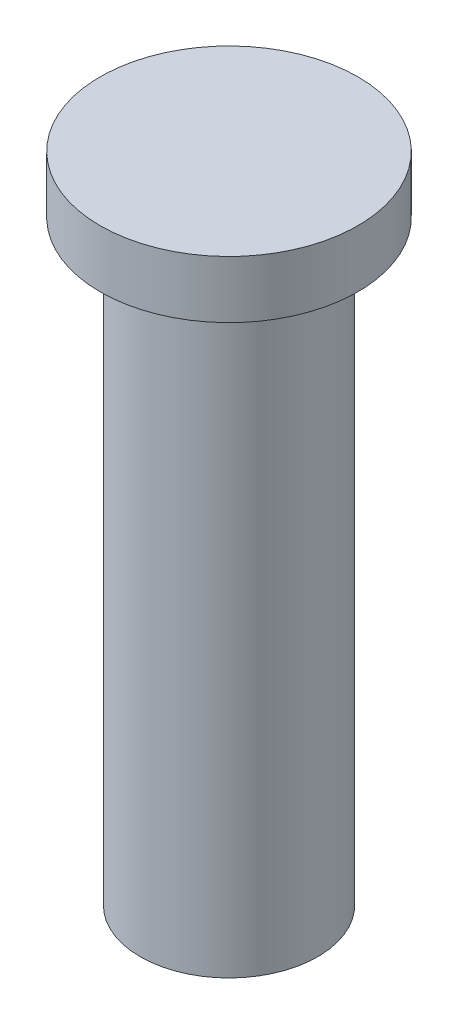
ISO-10303-21;
HEADER;
FILE_DESCRIPTION(('STEP AP214'),'2;1');
FILE_NAME('part.step','',(''),(''),'','','');
FILE_SCHEMA(('AUTOMOTIVE_DESIGN { 1 0 10303 214 1 1 1 1 }'));
ENDSEC;
DATA;
#1=APPLICATION_CONTEXT('core data for automotive mechanical design processes');
#2=APPLICATION_PROTOCOL_DEFINITION('international standard','automotive_design',2000,#1);
#3=PRODUCT_CONTEXT('',#1,'mechanical');
#4=PRODUCT('Part','Part','',(#3));
#5=PRODUCT_RELATED_PRODUCT_CATEGORY('part','',(#4));
#6=PRODUCT_DEFINITION_FORMATION('','',#4);
#7=PRODUCT_DEFINITION_CONTEXT('part definition',#1,'design');
#8=PRODUCT_DEFINITION('design','',#6,#7);
#9=PRODUCT_DEFINITION_SHAPE('','',#8);
#10=(LENGTH_UNIT() NAMED_UNIT(*) SI_UNIT(.MILLI.,.METRE.));
#11=(NAMED_UNIT(*) PLANE_ANGLE_UNIT() SI_UNIT($,.RADIAN.));
#12=(NAMED_UNIT(*) SI_UNIT($,.STERADIAN.) SOLID_ANGLE_UNIT());
#13=UNCERTAINTY_MEASURE_WITH_UNIT(LENGTH_MEASURE(1.E-05),#10,'distance_accuracy_value','');
#14=(GEOMETRIC_REPRESENTATION_CONTEXT(3) GLOBAL_UNCERTAINTY_ASSIGNED_CONTEXT((#13)) GLOBAL_UNIT_ASSIGNED_CONTEXT((#10,
#11,#12)) REPRESENTATION_CONTEXT('',''));
#15=CARTESIAN_POINT('',(0.,0.,0.));
#16=DIRECTION('',(0.,0.,1.));
#17=DIRECTION('',(1.,0.,0.));
#18=AXIS2_PLACEMENT_3D('',#15,#16,#17);
#19=CARTESIAN_POINT('',(0.,26.416,0.));
#20=DIRECTION('',(0.,-1.,0.));
#21=DIRECTION('',(0.,0.,-1.));
#22=AXIS2_PLACEMENT_3D('',#19,#20,#21);
#23=CYLINDRICAL_SURFACE('',#22,3.937);
#24=CARTESIAN_POINT('',(0.,26.416,0.));
#25=DIRECTION('',(0.,1.,0.));
#26=DIRECTION('',(0.,0.,1.));
#27=AXIS2_PLACEMENT_3D('',#24,#25,#26);
#28=CIRCLE('',#27,3.937);
#29=CARTESIAN_POINT('',(0.,26.416,3.937));
#30=VERTEX_POINT('',#29);
#31=EDGE_CURVE('E10',#30,#30,#28,.T.);
#32=ORIENTED_EDGE('',*,*,#31,.F.);
#33=EDGE_LOOP('',(#32));
#34=FACE_BOUND('',#33,.T.);
#35=CARTESIAN_POINT('',(0.,0.,0.));
#36=DIRECTION('',(0.,1.,0.));
#37=DIRECTION('',(0.,0.,1.));
#38=AXIS2_PLACEMENT_3D('',#35,#36,#37);
#39=CIRCLE('',#38,3.937);
#40=CARTESIAN_POINT('',(0.,0.,3.937));
#41=VERTEX_POINT('',#40);
#42=EDGE_CURVE('E42',#41,#41,#39,.T.);
#43=ORIENTED_EDGE('',*,*,#42,.T.);
#44=EDGE_LOOP('',(#43));
#45=FACE_BOUND('',#44,.T.);
#46=ADVANCED_FACE('F39',(#34,#45),#23,.T.);
#47=CARTESIAN_POINT('',(0.,0.,0.));
#48=DIRECTION('',(0.,1.,0.));
#49=DIRECTION('',(0.,0.,1.));
#50=AXIS2_PLACEMENT_3D('',#47,#48,#49);
#51=PLANE('',#50);
#52=ORIENTED_EDGE('',*,*,#42,.F.);
#53=EDGE_LOOP('',(#52));
#54=FACE_BOUND('',#53,.T.);
#55=ADVANCED_FACE('F66',(#54),#51,.F.);
#56=CARTESIAN_POINT('',(0.,28.956,0.));
#57=DIRECTION('',(0.,-1.,0.));
#58=DIRECTION('',(0.,0.,-1.));
#59=AXIS2_PLACEMENT_3D('',#56,#57,#58);
#60=CYLINDRICAL_SURFACE('',#59,5.715);
#61=CARTESIAN_POINT('',(0.,28.956,0.));
#62=DIRECTION('',(0.,1.,0.));
#63=DIRECTION('',(0.,0.,1.));
#64=AXIS2_PLACEMENT_3D('',#61,#62,#63);
#65=CIRCLE('',#64,5.715);
#66=CARTESIAN_POINT('',(0.,28.956,5.715));
#67=VERTEX_POINT('',#66);
#68=EDGE_CURVE('E51',#67,#67,#65,.T.);
#69=ORIENTED_EDGE('',*,*,#68,.F.);
#70=EDGE_LOOP('',(#69));
#71=FACE_BOUND('',#70,.T.);
#72=CARTESIAN_POINT('',(0.,26.416,0.));
#73=DIRECTION('',(0.,1.,0.));
#74=DIRECTION('',(0.,0.,1.));
#75=AXIS2_PLACEMENT_3D('',#72,#73,#74);
#76=CIRCLE('',#75,5.715);
#77=CARTESIAN_POINT('',(0.,26.416,5.715));
#78=VERTEX_POINT('',#77);
#79=EDGE_CURVE('E53',#78,#78,#76,.T.);
#80=ORIENTED_EDGE('',*,*,#79,.T.);
#81=EDGE_LOOP('',(#80));
#82=FACE_BOUND('',#81,.T.);
#83=ADVANCED_FACE('F63',(#71,#82),#60,.T.);
#84=CARTESIAN_POINT('',(0.,28.956,0.));
#85=DIRECTION('',(0.,1.,0.));
#86=DIRECTION('',(0.,0.,1.));
#87=AXIS2_PLACEMENT_3D('',#84,#85,#86);
#88=PLANE('',#87);
#89=ORIENTED_EDGE('',*,*,#68,.T.);
#90=EDGE_LOOP('',(#89));
#91=FACE_BOUND('',#90,.T.);
#92=ADVANCED_FACE('F61',(#91),#88,.T.);
#93=CARTESIAN_POINT('',(0.,26.416,0.));
#94=DIRECTION('',(0.,1.,0.));
#95=DIRECTION('',(0.,0.,1.));
#96=AXIS2_PLACEMENT_3D('',#93,#94,#95);
#97=PLANE('',#96);
#98=ORIENTED_EDGE('',*,*,#31,.T.);
#99=EDGE_LOOP('',(#98));
#100=FACE_BOUND('',#99,.T.);
#101=ORIENTED_EDGE('',*,*,#79,.F.);
#102=EDGE_LOOP('',(#101));
#103=FACE_BOUND('',#102,.T.);
#104=ADVANCED_FACE('F70',(#100,#103),#97,.F.);
#105=CLOSED_SHELL('',(#46,#55,#83,#92,#104));
#106=MANIFOLD_SOLID_BREP('B2',#105);
#107=ADVANCED_BREP_SHAPE_REPRESENTATION('',(#18,#106),#14);
#108=SHAPE_DEFINITION_REPRESENTATION(#9,#107);
ENDSEC;
END-ISO-10303-21;
